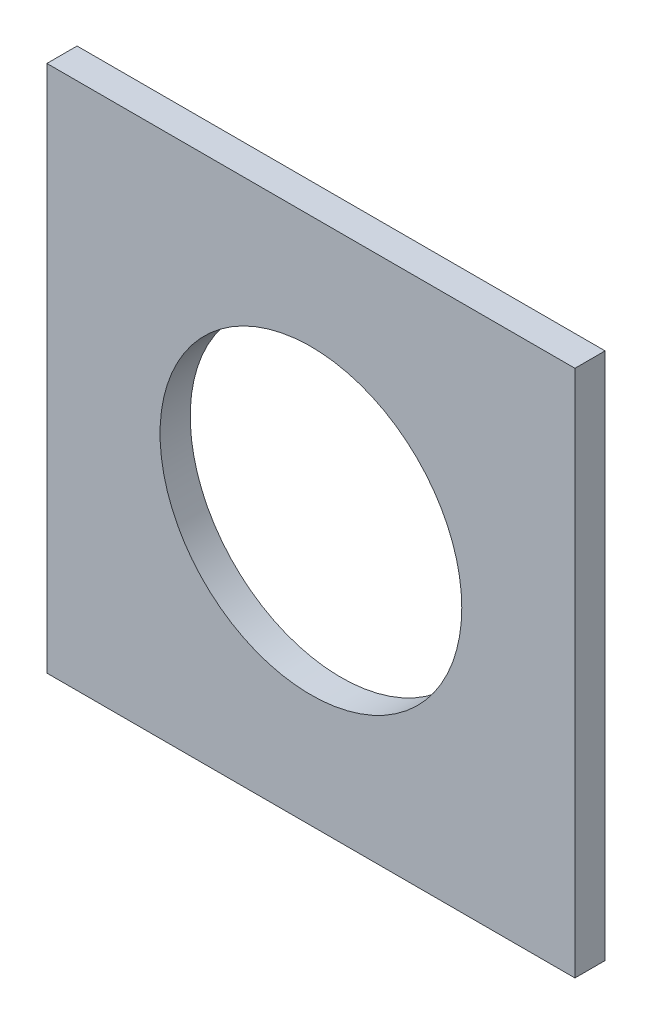
ISO-10303-21;
HEADER;
FILE_DESCRIPTION(('STEP AP214'),'2;1');
FILE_NAME('part.step','',(''),(''),'','','');
FILE_SCHEMA(('AUTOMOTIVE_DESIGN { 1 0 10303 214 1 1 1 1 }'));
ENDSEC;
DATA;
#1=APPLICATION_CONTEXT('core data for automotive mechanical design processes');
#2=APPLICATION_PROTOCOL_DEFINITION('international standard','automotive_design',2000,#1);
#3=PRODUCT_CONTEXT('',#1,'mechanical');
#4=PRODUCT('Part','Part','',(#3));
#5=PRODUCT_RELATED_PRODUCT_CATEGORY('part','',(#4));
#6=PRODUCT_DEFINITION_FORMATION('','',#4);
#7=PRODUCT_DEFINITION_CONTEXT('part definition',#1,'design');
#8=PRODUCT_DEFINITION('design','',#6,#7);
#9=PRODUCT_DEFINITION_SHAPE('','',#8);
#10=(LENGTH_UNIT() NAMED_UNIT(*) SI_UNIT(.MILLI.,.METRE.));
#11=(NAMED_UNIT(*) PLANE_ANGLE_UNIT() SI_UNIT($,.RADIAN.));
#12=(NAMED_UNIT(*) SI_UNIT($,.STERADIAN.) SOLID_ANGLE_UNIT());
#13=UNCERTAINTY_MEASURE_WITH_UNIT(LENGTH_MEASURE(1.E-05),#10,'distance_accuracy_value','');
#14=(GEOMETRIC_REPRESENTATION_CONTEXT(3) GLOBAL_UNCERTAINTY_ASSIGNED_CONTEXT((#13)) GLOBAL_UNIT_ASSIGNED_CONTEXT((#10,
#11,#12)) REPRESENTATION_CONTEXT('',''));
#15=CARTESIAN_POINT('',(0.,0.,0.));
#16=DIRECTION('',(0.,0.,1.));
#17=DIRECTION('',(1.,0.,0.));
#18=AXIS2_PLACEMENT_3D('',#15,#16,#17);
#19=CARTESIAN_POINT('',(350.,350.,40.));
#20=DIRECTION('',(-1.,0.,0.));
#21=DIRECTION('',(0.,-1.,0.));
#22=AXIS2_PLACEMENT_3D('',#19,#20,#21);
#23=PLANE('',#22);
#24=DIRECTION('',(0.,1.,0.));
#25=VECTOR('',#24,1.);
#26=CARTESIAN_POINT('',(350.,350.,0.));
#27=LINE('',#26,#25);
#28=CARTESIAN_POINT('',(350.,-350.,0.));
#29=VERTEX_POINT('',#28);
#30=CARTESIAN_POINT('',(350.,350.,0.));
#31=VERTEX_POINT('',#30);
#32=EDGE_CURVE('E113',#29,#31,#27,.T.);
#33=ORIENTED_EDGE('',*,*,#32,.T.);
#34=DIRECTION('',(0.,0.,-1.));
#35=VECTOR('',#34,1.);
#36=CARTESIAN_POINT('',(350.,350.,40.));
#37=LINE('',#36,#35);
#38=CARTESIAN_POINT('',(350.,350.,40.));
#39=VERTEX_POINT('',#38);
#40=EDGE_CURVE('E11',#39,#31,#37,.T.);
#41=ORIENTED_EDGE('',*,*,#40,.F.);
#42=DIRECTION('',(0.,1.,0.));
#43=VECTOR('',#42,1.);
#44=CARTESIAN_POINT('',(350.,350.,40.));
#45=LINE('',#44,#43);
#46=CARTESIAN_POINT('',(350.,-350.,40.));
#47=VERTEX_POINT('',#46);
#48=EDGE_CURVE('E97',#47,#39,#45,.T.);
#49=ORIENTED_EDGE('',*,*,#48,.F.);
#50=DIRECTION('',(0.,0.,-1.));
#51=VECTOR('',#50,1.);
#52=CARTESIAN_POINT('',(350.,-350.,40.));
#53=LINE('',#52,#51);
#54=EDGE_CURVE('E109',#47,#29,#53,.T.);
#55=ORIENTED_EDGE('',*,*,#54,.T.);
#56=EDGE_LOOP('',(#33,#41,#49,#55));
#57=FACE_BOUND('',#56,.T.);
#58=ADVANCED_FACE('F45',(#57),#23,.F.);
#59=CARTESIAN_POINT('',(-350.,350.,40.));
#60=DIRECTION('',(0.,-1.,0.));
#61=DIRECTION('',(0.,0.,-1.));
#62=AXIS2_PLACEMENT_3D('',#59,#60,#61);
#63=PLANE('',#62);
#64=DIRECTION('',(-1.,0.,0.));
#65=VECTOR('',#64,1.);
#66=CARTESIAN_POINT('',(-350.,350.,0.));
#67=LINE('',#66,#65);
#68=CARTESIAN_POINT('',(-350.,350.,0.));
#69=VERTEX_POINT('',#68);
#70=EDGE_CURVE('E102',#31,#69,#67,.T.);
#71=ORIENTED_EDGE('',*,*,#70,.T.);
#72=DIRECTION('',(0.,0.,-1.));
#73=VECTOR('',#72,1.);
#74=CARTESIAN_POINT('',(-350.,350.,40.));
#75=LINE('',#74,#73);
#76=CARTESIAN_POINT('',(-350.,350.,40.));
#77=VERTEX_POINT('',#76);
#78=EDGE_CURVE('E54',#77,#69,#75,.T.);
#79=ORIENTED_EDGE('',*,*,#78,.F.);
#80=DIRECTION('',(-1.,0.,0.));
#81=VECTOR('',#80,1.);
#82=CARTESIAN_POINT('',(-350.,350.,40.));
#83=LINE('',#82,#81);
#84=EDGE_CURVE('E92',#39,#77,#83,.T.);
#85=ORIENTED_EDGE('',*,*,#84,.F.);
#86=ORIENTED_EDGE('',*,*,#40,.T.);
#87=EDGE_LOOP('',(#71,#79,#85,#86));
#88=FACE_BOUND('',#87,.T.);
#89=ADVANCED_FACE('F101',(#88),#63,.F.);
#90=CARTESIAN_POINT('',(-350.,350.,40.));
#91=DIRECTION('',(1.,0.,0.));
#92=DIRECTION('',(0.,1.,0.));
#93=AXIS2_PLACEMENT_3D('',#90,#91,#92);
#94=PLANE('',#93);
#95=DIRECTION('',(0.,-1.,0.));
#96=VECTOR('',#95,1.);
#97=CARTESIAN_POINT('',(-350.,350.,0.));
#98=LINE('',#97,#96);
#99=CARTESIAN_POINT('',(-350.,-350.,0.));
#100=VERTEX_POINT('',#99);
#101=EDGE_CURVE('E79',#69,#100,#98,.T.);
#102=ORIENTED_EDGE('',*,*,#101,.T.);
#103=DIRECTION('',(0.,0.,-1.));
#104=VECTOR('',#103,1.);
#105=CARTESIAN_POINT('',(-350.,-350.,40.));
#106=LINE('',#105,#104);
#107=CARTESIAN_POINT('',(-350.,-350.,40.));
#108=VERTEX_POINT('',#107);
#109=EDGE_CURVE('E104',#108,#100,#106,.T.);
#110=ORIENTED_EDGE('',*,*,#109,.F.);
#111=DIRECTION('',(0.,-1.,0.));
#112=VECTOR('',#111,1.);
#113=CARTESIAN_POINT('',(-350.,350.,40.));
#114=LINE('',#113,#112);
#115=EDGE_CURVE('E95',#77,#108,#114,.T.);
#116=ORIENTED_EDGE('',*,*,#115,.F.);
#117=ORIENTED_EDGE('',*,*,#78,.T.);
#118=EDGE_LOOP('',(#102,#110,#116,#117));
#119=FACE_BOUND('',#118,.T.);
#120=ADVANCED_FACE('F105',(#119),#94,.F.);
#121=CARTESIAN_POINT('',(-350.,-350.,40.));
#122=DIRECTION('',(0.,1.,0.));
#123=DIRECTION('',(0.,0.,1.));
#124=AXIS2_PLACEMENT_3D('',#121,#122,#123);
#125=PLANE('',#124);
#126=DIRECTION('',(1.,0.,0.));
#127=VECTOR('',#126,1.);
#128=CARTESIAN_POINT('',(-350.,-350.,0.));
#129=LINE('',#128,#127);
#130=EDGE_CURVE('E85',#100,#29,#129,.T.);
#131=ORIENTED_EDGE('',*,*,#130,.T.);
#132=ORIENTED_EDGE('',*,*,#54,.F.);
#133=DIRECTION('',(1.,0.,0.));
#134=VECTOR('',#133,1.);
#135=CARTESIAN_POINT('',(-350.,-350.,40.));
#136=LINE('',#135,#134);
#137=EDGE_CURVE('E62',#108,#47,#136,.T.);
#138=ORIENTED_EDGE('',*,*,#137,.F.);
#139=ORIENTED_EDGE('',*,*,#109,.T.);
#140=EDGE_LOOP('',(#131,#132,#138,#139));
#141=FACE_BOUND('',#140,.T.);
#142=ADVANCED_FACE('F127',(#141),#125,.F.);
#143=CARTESIAN_POINT('',(0.,0.,40.));
#144=DIRECTION('',(0.,0.,1.));
#145=DIRECTION('',(1.,0.,0.));
#146=AXIS2_PLACEMENT_3D('',#143,#144,#145);
#147=PLANE('',#146);
#148=CARTESIAN_POINT('',(0.,0.,40.));
#149=DIRECTION('',(0.,0.,1.));
#150=DIRECTION('',(1.,0.,0.));
#151=AXIS2_PLACEMENT_3D('',#148,#149,#150);
#152=CIRCLE('',#151,200.);
#153=CARTESIAN_POINT('',(200.,0.,40.));
#154=VERTEX_POINT('',#153);
#155=EDGE_CURVE('E134',#154,#154,#152,.T.);
#156=ORIENTED_EDGE('',*,*,#155,.F.);
#157=EDGE_LOOP('',(#156));
#158=FACE_BOUND('',#157,.T.);
#159=ORIENTED_EDGE('',*,*,#48,.T.);
#160=ORIENTED_EDGE('',*,*,#84,.T.);
#161=ORIENTED_EDGE('',*,*,#115,.T.);
#162=ORIENTED_EDGE('',*,*,#137,.T.);
#163=EDGE_LOOP('',(#159,#160,#161,#162));
#164=FACE_BOUND('',#163,.T.);
#165=ADVANCED_FACE('F93',(#158,#164),#147,.T.);
#166=CARTESIAN_POINT('',(0.,0.,0.));
#167=DIRECTION('',(0.,0.,1.));
#168=DIRECTION('',(1.,0.,0.));
#169=AXIS2_PLACEMENT_3D('',#166,#167,#168);
#170=PLANE('',#169);
#171=CARTESIAN_POINT('',(0.,0.,0.));
#172=DIRECTION('',(0.,0.,1.));
#173=DIRECTION('',(1.,0.,0.));
#174=AXIS2_PLACEMENT_3D('',#171,#172,#173);
#175=CIRCLE('',#174,200.);
#176=CARTESIAN_POINT('',(200.,0.,0.));
#177=VERTEX_POINT('',#176);
#178=EDGE_CURVE('E117',#177,#177,#175,.T.);
#179=ORIENTED_EDGE('',*,*,#178,.T.);
#180=EDGE_LOOP('',(#179));
#181=FACE_BOUND('',#180,.T.);
#182=ORIENTED_EDGE('',*,*,#32,.F.);
#183=ORIENTED_EDGE('',*,*,#130,.F.);
#184=ORIENTED_EDGE('',*,*,#101,.F.);
#185=ORIENTED_EDGE('',*,*,#70,.F.);
#186=EDGE_LOOP('',(#182,#183,#184,#185));
#187=FACE_BOUND('',#186,.T.);
#188=ADVANCED_FACE('F130',(#181,#187),#170,.F.);
#189=CARTESIAN_POINT('',(0.,0.,0.));
#190=DIRECTION('',(0.,0.,1.));
#191=DIRECTION('',(1.,0.,0.));
#192=AXIS2_PLACEMENT_3D('',#189,#190,#191);
#193=CYLINDRICAL_SURFACE('',#192,200.);
#194=ORIENTED_EDGE('',*,*,#178,.F.);
#195=EDGE_LOOP('',(#194));
#196=FACE_BOUND('',#195,.T.);
#197=ORIENTED_EDGE('',*,*,#155,.T.);
#198=EDGE_LOOP('',(#197));
#199=FACE_BOUND('',#198,.T.);
#200=ADVANCED_FACE('F143',(#196,#199),#193,.F.);
#201=CLOSED_SHELL('',(#58,#89,#120,#142,#165,#188,#200));
#202=MANIFOLD_SOLID_BREP('B2',#201);
#203=ADVANCED_BREP_SHAPE_REPRESENTATION('',(#18,#202),#14);
#204=SHAPE_DEFINITION_REPRESENTATION(#9,#203);
ENDSEC;
END-ISO-10303-21;
